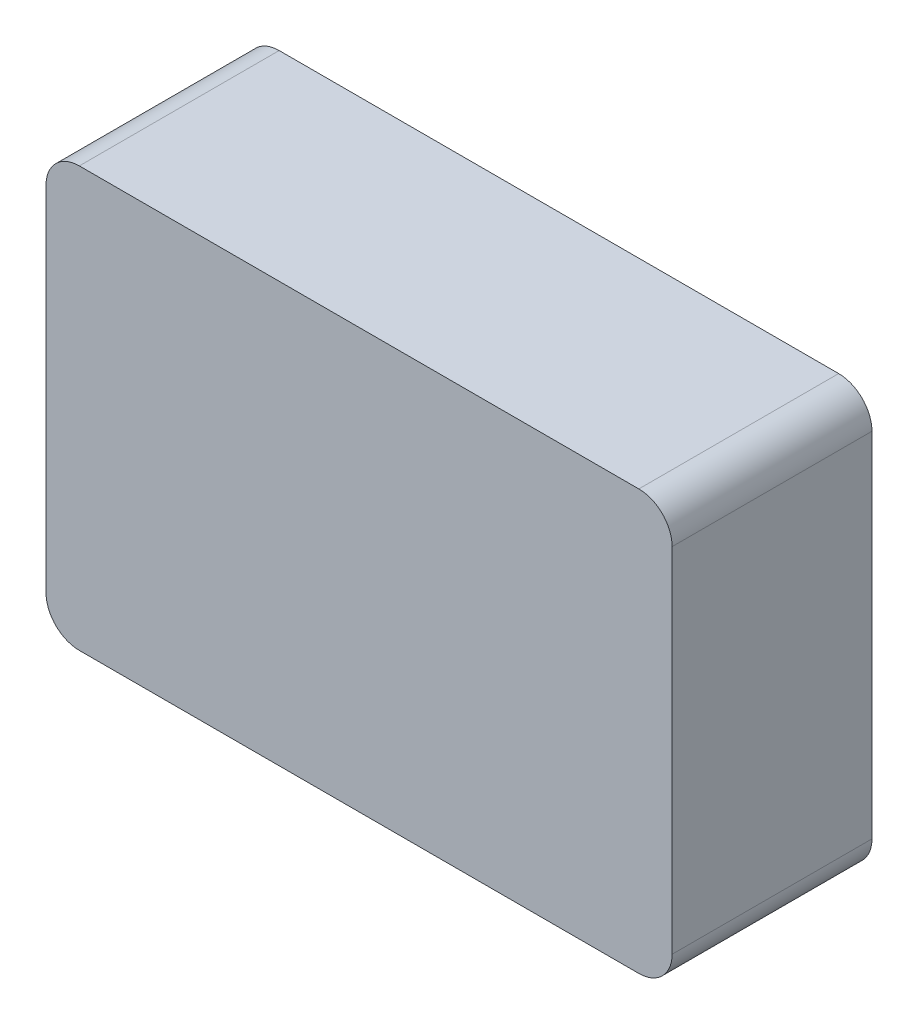
ISO-10303-21;
HEADER;
FILE_DESCRIPTION(('STEP AP214'),'2;1');
FILE_NAME('part.step','',(''),(''),'','','');
FILE_SCHEMA(('AUTOMOTIVE_DESIGN { 1 0 10303 214 1 1 1 1 }'));
ENDSEC;
DATA;
#1=APPLICATION_CONTEXT('core data for automotive mechanical design processes');
#2=APPLICATION_PROTOCOL_DEFINITION('international standard','automotive_design',2000,#1);
#3=PRODUCT_CONTEXT('',#1,'mechanical');
#4=PRODUCT('Part','Part','',(#3));
#5=PRODUCT_RELATED_PRODUCT_CATEGORY('part','',(#4));
#6=PRODUCT_DEFINITION_FORMATION('','',#4);
#7=PRODUCT_DEFINITION_CONTEXT('part definition',#1,'design');
#8=PRODUCT_DEFINITION('design','',#6,#7);
#9=PRODUCT_DEFINITION_SHAPE('','',#8);
#10=(LENGTH_UNIT() NAMED_UNIT(*) SI_UNIT(.MILLI.,.METRE.));
#11=(NAMED_UNIT(*) PLANE_ANGLE_UNIT() SI_UNIT($,.RADIAN.));
#12=(NAMED_UNIT(*) SI_UNIT($,.STERADIAN.) SOLID_ANGLE_UNIT());
#13=UNCERTAINTY_MEASURE_WITH_UNIT(LENGTH_MEASURE(1.E-05),#10,'distance_accuracy_value','');
#14=(GEOMETRIC_REPRESENTATION_CONTEXT(3) GLOBAL_UNCERTAINTY_ASSIGNED_CONTEXT((#13)) GLOBAL_UNIT_ASSIGNED_CONTEXT((#10,
#11,#12)) REPRESENTATION_CONTEXT('',''));
#15=CARTESIAN_POINT('',(0.,0.,0.));
#16=DIRECTION('',(0.,0.,1.));
#17=DIRECTION('',(1.,0.,0.));
#18=AXIS2_PLACEMENT_3D('',#15,#16,#17);
#19=CARTESIAN_POINT('',(-47.,26.5,30.));
#20=DIRECTION('',(1.,0.,0.));
#21=DIRECTION('',(0.,1.,0.));
#22=AXIS2_PLACEMENT_3D('',#19,#20,#21);
#23=PLANE('',#22);
#24=DIRECTION('',(0.,0.,-1.));
#25=VECTOR('',#24,1.);
#26=CARTESIAN_POINT('',(-47.,-26.5,30.));
#27=LINE('',#26,#25);
#28=CARTESIAN_POINT('',(-47.,-26.5,5.));
#29=VERTEX_POINT('',#28);
#30=CARTESIAN_POINT('',(-47.,-26.5,0.));
#31=VERTEX_POINT('',#30);
#32=EDGE_CURVE('E374',#29,#31,#27,.T.);
#33=ORIENTED_EDGE('',*,*,#32,.F.);
#34=DIRECTION('',(0.,-1.,0.));
#35=VECTOR('',#34,1.);
#36=CARTESIAN_POINT('',(-47.,26.5,5.));
#37=LINE('',#36,#35);
#38=CARTESIAN_POINT('',(-47.,26.5,5.));
#39=VERTEX_POINT('',#38);
#40=EDGE_CURVE('E48',#39,#29,#37,.T.);
#41=ORIENTED_EDGE('',*,*,#40,.F.);
#42=DIRECTION('',(0.,0.,-1.));
#43=VECTOR('',#42,1.);
#44=CARTESIAN_POINT('',(-47.,26.5,30.));
#45=LINE('',#44,#43);
#46=CARTESIAN_POINT('',(-47.,26.5,0.));
#47=VERTEX_POINT('',#46);
#48=EDGE_CURVE('E378',#39,#47,#45,.T.);
#49=ORIENTED_EDGE('',*,*,#48,.T.);
#50=DIRECTION('',(0.,-1.,0.));
#51=VECTOR('',#50,1.);
#52=CARTESIAN_POINT('',(-47.,26.5,0.));
#53=LINE('',#52,#51);
#54=EDGE_CURVE('E363',#47,#31,#53,.T.);
#55=ORIENTED_EDGE('',*,*,#54,.T.);
#56=EDGE_LOOP('',(#33,#41,#49,#55));
#57=FACE_BOUND('',#56,.T.);
#58=ADVANCED_FACE('F33',(#57),#23,.F.);
#59=CARTESIAN_POINT('',(42.,-26.5,30.));
#60=DIRECTION('',(0.,0.,-1.));
#61=DIRECTION('',(-1.,0.,0.));
#62=AXIS2_PLACEMENT_3D('',#59,#60,#61);
#63=CYLINDRICAL_SURFACE('',#62,5.);
#64=CARTESIAN_POINT('',(42.,-26.5,0.));
#65=DIRECTION('',(0.,0.,1.));
#66=DIRECTION('',(1.,0.,0.));
#67=AXIS2_PLACEMENT_3D('',#64,#65,#66);
#68=CIRCLE('',#67,5.);
#69=CARTESIAN_POINT('',(42.,-31.5,0.));
#70=VERTEX_POINT('',#69);
#71=CARTESIAN_POINT('',(47.,-26.5,0.));
#72=VERTEX_POINT('',#71);
#73=EDGE_CURVE('E259',#70,#72,#68,.T.);
#74=ORIENTED_EDGE('',*,*,#73,.T.);
#75=DIRECTION('',(0.,0.,-1.));
#76=VECTOR('',#75,1.);
#77=CARTESIAN_POINT('',(47.,-26.5,30.));
#78=LINE('',#77,#76);
#79=CARTESIAN_POINT('',(47.,-26.5,30.));
#80=VERTEX_POINT('',#79);
#81=EDGE_CURVE('E11',#80,#72,#78,.T.);
#82=ORIENTED_EDGE('',*,*,#81,.F.);
#83=CARTESIAN_POINT('',(42.,-26.5,30.));
#84=DIRECTION('',(0.,0.,1.));
#85=DIRECTION('',(1.,0.,0.));
#86=AXIS2_PLACEMENT_3D('',#83,#84,#85);
#87=CIRCLE('',#86,5.);
#88=CARTESIAN_POINT('',(42.,-31.5,30.));
#89=VERTEX_POINT('',#88);
#90=EDGE_CURVE('E333',#89,#80,#87,.T.);
#91=ORIENTED_EDGE('',*,*,#90,.F.);
#92=DIRECTION('',(0.,0.,-1.));
#93=VECTOR('',#92,1.);
#94=CARTESIAN_POINT('',(42.,-31.5,30.));
#95=LINE('',#94,#93);
#96=EDGE_CURVE('E351',#89,#70,#95,.T.);
#97=ORIENTED_EDGE('',*,*,#96,.T.);
#98=EDGE_LOOP('',(#74,#82,#91,#97));
#99=FACE_BOUND('',#98,.T.);
#100=ADVANCED_FACE('F35',(#99),#63,.T.);
#101=CARTESIAN_POINT('',(47.,26.5,30.));
#102=DIRECTION('',(-1.,0.,0.));
#103=DIRECTION('',(0.,-1.,0.));
#104=AXIS2_PLACEMENT_3D('',#101,#102,#103);
#105=PLANE('',#104);
#106=DIRECTION('',(0.,1.,0.));
#107=VECTOR('',#106,1.);
#108=CARTESIAN_POINT('',(47.,26.5,0.));
#109=LINE('',#108,#107);
#110=CARTESIAN_POINT('',(47.,26.5,0.));
#111=VERTEX_POINT('',#110);
#112=EDGE_CURVE('E354',#72,#111,#109,.T.);
#113=ORIENTED_EDGE('',*,*,#112,.T.);
#114=DIRECTION('',(0.,0.,-1.));
#115=VECTOR('',#114,1.);
#116=CARTESIAN_POINT('',(47.,26.5,30.));
#117=LINE('',#116,#115);
#118=CARTESIAN_POINT('',(47.,26.5,30.));
#119=VERTEX_POINT('',#118);
#120=EDGE_CURVE('E41',#119,#111,#117,.T.);
#121=ORIENTED_EDGE('',*,*,#120,.F.);
#122=DIRECTION('',(0.,1.,0.));
#123=VECTOR('',#122,1.);
#124=CARTESIAN_POINT('',(47.,26.5,30.));
#125=LINE('',#124,#123);
#126=EDGE_CURVE('E336',#80,#119,#125,.T.);
#127=ORIENTED_EDGE('',*,*,#126,.F.);
#128=ORIENTED_EDGE('',*,*,#81,.T.);
#129=EDGE_LOOP('',(#113,#121,#127,#128));
#130=FACE_BOUND('',#129,.T.);
#131=ADVANCED_FACE('F417',(#130),#105,.F.);
#132=CARTESIAN_POINT('',(42.,26.5,30.));
#133=DIRECTION('',(0.,0.,-1.));
#134=DIRECTION('',(-1.,0.,0.));
#135=AXIS2_PLACEMENT_3D('',#132,#133,#134);
#136=CYLINDRICAL_SURFACE('',#135,5.);
#137=CARTESIAN_POINT('',(42.,26.5,0.));
#138=DIRECTION('',(0.,0.,1.));
#139=DIRECTION('',(1.,0.,0.));
#140=AXIS2_PLACEMENT_3D('',#137,#138,#139);
#141=CIRCLE('',#140,5.);
#142=CARTESIAN_POINT('',(42.,31.5,0.));
#143=VERTEX_POINT('',#142);
#144=EDGE_CURVE('E356',#111,#143,#141,.T.);
#145=ORIENTED_EDGE('',*,*,#144,.T.);
#146=DIRECTION('',(0.,0.,-1.));
#147=VECTOR('',#146,1.);
#148=CARTESIAN_POINT('',(42.,31.5,30.));
#149=LINE('',#148,#147);
#150=CARTESIAN_POINT('',(42.,31.5,30.));
#151=VERTEX_POINT('',#150);
#152=EDGE_CURVE('E385',#151,#143,#149,.T.);
#153=ORIENTED_EDGE('',*,*,#152,.F.);
#154=CARTESIAN_POINT('',(42.,26.5,30.));
#155=DIRECTION('',(0.,0.,1.));
#156=DIRECTION('',(1.,0.,0.));
#157=AXIS2_PLACEMENT_3D('',#154,#155,#156);
#158=CIRCLE('',#157,5.);
#159=EDGE_CURVE('E339',#119,#151,#158,.T.);
#160=ORIENTED_EDGE('',*,*,#159,.F.);
#161=ORIENTED_EDGE('',*,*,#120,.T.);
#162=EDGE_LOOP('',(#145,#153,#160,#161));
#163=FACE_BOUND('',#162,.T.);
#164=ADVANCED_FACE('F392',(#163),#136,.T.);
#165=CARTESIAN_POINT('',(-42.,31.5,30.));
#166=DIRECTION('',(0.,-1.,0.));
#167=DIRECTION('',(0.,0.,-1.));
#168=AXIS2_PLACEMENT_3D('',#165,#166,#167);
#169=PLANE('',#168);
#170=DIRECTION('',(-1.,0.,0.));
#171=VECTOR('',#170,1.);
#172=CARTESIAN_POINT('',(-42.,31.5,0.));
#173=LINE('',#172,#171);
#174=CARTESIAN_POINT('',(-42.,31.5,0.));
#175=VERTEX_POINT('',#174);
#176=EDGE_CURVE('E358',#143,#175,#173,.T.);
#177=ORIENTED_EDGE('',*,*,#176,.T.);
#178=DIRECTION('',(0.,0.,-1.));
#179=VECTOR('',#178,1.);
#180=CARTESIAN_POINT('',(-42.,31.5,30.));
#181=LINE('',#180,#179);
#182=CARTESIAN_POINT('',(-42.,31.5,30.));
#183=VERTEX_POINT('',#182);
#184=EDGE_CURVE('E382',#183,#175,#181,.T.);
#185=ORIENTED_EDGE('',*,*,#184,.F.);
#186=DIRECTION('',(-1.,0.,0.));
#187=VECTOR('',#186,1.);
#188=CARTESIAN_POINT('',(-42.,31.5,30.));
#189=LINE('',#188,#187);
#190=EDGE_CURVE('E341',#151,#183,#189,.T.);
#191=ORIENTED_EDGE('',*,*,#190,.F.);
#192=ORIENTED_EDGE('',*,*,#152,.T.);
#193=EDGE_LOOP('',(#177,#185,#191,#192));
#194=FACE_BOUND('',#193,.T.);
#195=ADVANCED_FACE('F403',(#194),#169,.F.);
#196=CARTESIAN_POINT('',(-42.,26.5,30.));
#197=DIRECTION('',(0.,0.,-1.));
#198=DIRECTION('',(-1.,0.,0.));
#199=AXIS2_PLACEMENT_3D('',#196,#197,#198);
#200=CYLINDRICAL_SURFACE('',#199,5.);
#201=CARTESIAN_POINT('',(-42.,26.5,0.));
#202=DIRECTION('',(0.,0.,1.));
#203=DIRECTION('',(-1.,0.,0.));
#204=AXIS2_PLACEMENT_3D('',#201,#202,#203);
#205=CIRCLE('',#204,5.);
#206=EDGE_CURVE('E360',#175,#47,#205,.T.);
#207=ORIENTED_EDGE('',*,*,#206,.T.);
#208=ORIENTED_EDGE('',*,*,#48,.F.);
#209=DIRECTION('',(0.,0.,-1.));
#210=VECTOR('',#209,1.);
#211=CARTESIAN_POINT('',(-47.,26.5,5.));
#212=LINE('',#211,#210);
#213=CARTESIAN_POINT('',(-47.,26.5,25.));
#214=VERTEX_POINT('',#213);
#215=EDGE_CURVE('E214',#214,#39,#212,.T.);
#216=ORIENTED_EDGE('',*,*,#215,.F.);
#217=CARTESIAN_POINT('',(-47.,26.5,30.));
#218=VERTEX_POINT('',#217);
#219=EDGE_CURVE('E379',#218,#214,#45,.T.);
#220=ORIENTED_EDGE('',*,*,#219,.F.);
#221=CARTESIAN_POINT('',(-42.,26.5,30.));
#222=DIRECTION('',(0.,0.,1.));
#223=DIRECTION('',(-1.,0.,0.));
#224=AXIS2_PLACEMENT_3D('',#221,#222,#223);
#225=CIRCLE('',#224,5.);
#226=EDGE_CURVE('E343',#183,#218,#225,.T.);
#227=ORIENTED_EDGE('',*,*,#226,.F.);
#228=ORIENTED_EDGE('',*,*,#184,.T.);
#229=EDGE_LOOP('',(#207,#208,#216,#220,#227,#228));
#230=FACE_BOUND('',#229,.T.);
#231=ADVANCED_FACE('F407',(#230),#200,.T.);
#232=ORIENTED_EDGE('',*,*,#219,.T.);
#233=DIRECTION('',(0.,1.,0.));
#234=VECTOR('',#233,1.);
#235=CARTESIAN_POINT('',(-47.,26.5,25.));
#236=LINE('',#235,#234);
#237=CARTESIAN_POINT('',(-47.,-26.5,25.));
#238=VERTEX_POINT('',#237);
#239=EDGE_CURVE('E217',#238,#214,#236,.T.);
#240=ORIENTED_EDGE('',*,*,#239,.F.);
#241=CARTESIAN_POINT('',(-47.,-26.5,30.));
#242=VERTEX_POINT('',#241);
#243=EDGE_CURVE('E375',#242,#238,#27,.T.);
#244=ORIENTED_EDGE('',*,*,#243,.F.);
#245=DIRECTION('',(0.,-1.,0.));
#246=VECTOR('',#245,1.);
#247=CARTESIAN_POINT('',(-47.,26.5,30.));
#248=LINE('',#247,#246);
#249=EDGE_CURVE('E345',#218,#242,#248,.T.);
#250=ORIENTED_EDGE('',*,*,#249,.F.);
#251=EDGE_LOOP('',(#232,#240,#244,#250));
#252=FACE_BOUND('',#251,.T.);
#253=ADVANCED_FACE('F434',(#252),#23,.F.);
#254=CARTESIAN_POINT('',(-42.,-26.5,30.));
#255=DIRECTION('',(0.,0.,-1.));
#256=DIRECTION('',(-1.,0.,0.));
#257=AXIS2_PLACEMENT_3D('',#254,#255,#256);
#258=CYLINDRICAL_SURFACE('',#257,5.);
#259=CARTESIAN_POINT('',(-42.,-26.5,0.));
#260=DIRECTION('',(0.,0.,1.));
#261=DIRECTION('',(-1.,0.,0.));
#262=AXIS2_PLACEMENT_3D('',#259,#260,#261);
#263=CIRCLE('',#262,5.);
#264=CARTESIAN_POINT('',(-42.,-31.5,0.));
#265=VERTEX_POINT('',#264);
#266=EDGE_CURVE('E366',#31,#265,#263,.T.);
#267=ORIENTED_EDGE('',*,*,#266,.T.);
#268=DIRECTION('',(0.,0.,-1.));
#269=VECTOR('',#268,1.);
#270=CARTESIAN_POINT('',(-42.,-31.5,30.));
#271=LINE('',#270,#269);
#272=CARTESIAN_POINT('',(-42.,-31.5,30.));
#273=VERTEX_POINT('',#272);
#274=EDGE_CURVE('E371',#273,#265,#271,.T.);
#275=ORIENTED_EDGE('',*,*,#274,.F.);
#276=CARTESIAN_POINT('',(-42.,-26.5,30.));
#277=DIRECTION('',(0.,0.,1.));
#278=DIRECTION('',(-1.,0.,0.));
#279=AXIS2_PLACEMENT_3D('',#276,#277,#278);
#280=CIRCLE('',#279,5.);
#281=EDGE_CURVE('E347',#242,#273,#280,.T.);
#282=ORIENTED_EDGE('',*,*,#281,.F.);
#283=ORIENTED_EDGE('',*,*,#243,.T.);
#284=DIRECTION('',(0.,0.,1.));
#285=VECTOR('',#284,1.);
#286=CARTESIAN_POINT('',(-47.,-26.5,5.00000000000001));
#287=LINE('',#286,#285);
#288=EDGE_CURVE('E223',#29,#238,#287,.T.);
#289=ORIENTED_EDGE('',*,*,#288,.F.);
#290=ORIENTED_EDGE('',*,*,#32,.T.);
#291=EDGE_LOOP('',(#267,#275,#282,#283,#289,#290));
#292=FACE_BOUND('',#291,.T.);
#293=ADVANCED_FACE('F428',(#292),#258,.T.);
#294=CARTESIAN_POINT('',(-42.,-31.5,30.));
#295=DIRECTION('',(0.,1.,0.));
#296=DIRECTION('',(0.,0.,1.));
#297=AXIS2_PLACEMENT_3D('',#294,#295,#296);
#298=PLANE('',#297);
#299=DIRECTION('',(1.,0.,0.));
#300=VECTOR('',#299,1.);
#301=CARTESIAN_POINT('',(-35.,-31.5,8.));
#302=LINE('',#301,#300);
#303=CARTESIAN_POINT('',(-35.,-31.5,8.));
#304=VERTEX_POINT('',#303);
#305=CARTESIAN_POINT('',(-27.,-31.5,8.));
#306=VERTEX_POINT('',#305);
#307=EDGE_CURVE('E248',#304,#306,#302,.T.);
#308=ORIENTED_EDGE('',*,*,#307,.F.);
#309=CARTESIAN_POINT('',(-35.,-31.5,10.));
#310=DIRECTION('',(0.,-1.,0.));
#311=DIRECTION('',(0.,0.,-1.));
#312=AXIS2_PLACEMENT_3D('',#309,#310,#311);
#313=CIRCLE('',#312,2.);
#314=CARTESIAN_POINT('',(-35.,-31.5,12.));
#315=VERTEX_POINT('',#314);
#316=EDGE_CURVE('E56',#315,#304,#313,.T.);
#317=ORIENTED_EDGE('',*,*,#316,.F.);
#318=DIRECTION('',(-1.,0.,0.));
#319=VECTOR('',#318,1.);
#320=CARTESIAN_POINT('',(-35.,-31.5,12.));
#321=LINE('',#320,#319);
#322=CARTESIAN_POINT('',(-27.,-31.5,12.));
#323=VERTEX_POINT('',#322);
#324=EDGE_CURVE('E237',#323,#315,#321,.T.);
#325=ORIENTED_EDGE('',*,*,#324,.F.);
#326=CARTESIAN_POINT('',(-27.,-31.5,10.));
#327=DIRECTION('',(0.,-1.,0.));
#328=DIRECTION('',(0.,0.,-1.));
#329=AXIS2_PLACEMENT_3D('',#326,#327,#328);
#330=CIRCLE('',#329,2.);
#331=EDGE_CURVE('E252',#306,#323,#330,.T.);
#332=ORIENTED_EDGE('',*,*,#331,.F.);
#333=EDGE_LOOP('',(#308,#317,#325,#332));
#334=FACE_BOUND('',#333,.T.);
#335=DIRECTION('',(1.,0.,0.));
#336=VECTOR('',#335,1.);
#337=CARTESIAN_POINT('',(-19.,-31.5,8.));
#338=LINE('',#337,#336);
#339=CARTESIAN_POINT('',(-19.,-31.5,8.));
#340=VERTEX_POINT('',#339);
#341=CARTESIAN_POINT('',(-11.,-31.5,8.));
#342=VERTEX_POINT('',#341);
#343=EDGE_CURVE('E281',#340,#342,#338,.T.);
#344=ORIENTED_EDGE('',*,*,#343,.F.);
#345=CARTESIAN_POINT('',(-19.,-31.5,10.));
#346=DIRECTION('',(0.,-1.,0.));
#347=DIRECTION('',(0.,0.,-1.));
#348=AXIS2_PLACEMENT_3D('',#345,#346,#347);
#349=CIRCLE('',#348,2.);
#350=CARTESIAN_POINT('',(-19.,-31.5,12.));
#351=VERTEX_POINT('',#350);
#352=EDGE_CURVE('E279',#351,#340,#349,.T.);
#353=ORIENTED_EDGE('',*,*,#352,.F.);
#354=DIRECTION('',(-1.,0.,0.));
#355=VECTOR('',#354,1.);
#356=CARTESIAN_POINT('',(-19.,-31.5,12.));
#357=LINE('',#356,#355);
#358=CARTESIAN_POINT('',(-11.,-31.5,12.));
#359=VERTEX_POINT('',#358);
#360=EDGE_CURVE('E269',#359,#351,#357,.T.);
#361=ORIENTED_EDGE('',*,*,#360,.F.);
#362=CARTESIAN_POINT('',(-11.,-31.5,10.));
#363=DIRECTION('',(0.,-1.,0.));
#364=DIRECTION('',(0.,0.,-1.));
#365=AXIS2_PLACEMENT_3D('',#362,#363,#364);
#366=CIRCLE('',#365,2.);
#367=EDGE_CURVE('E285',#342,#359,#366,.T.);
#368=ORIENTED_EDGE('',*,*,#367,.F.);
#369=EDGE_LOOP('',(#344,#353,#361,#368));
#370=FACE_BOUND('',#369,.T.);
#371=DIRECTION('',(1.,0.,0.));
#372=VECTOR('',#371,1.);
#373=CARTESIAN_POINT('',(-3.,-31.5,8.));
#374=LINE('',#373,#372);
#375=CARTESIAN_POINT('',(-3.,-31.5,8.));
#376=VERTEX_POINT('',#375);
#377=CARTESIAN_POINT('',(5.,-31.5,8.));
#378=VERTEX_POINT('',#377);
#379=EDGE_CURVE('E313',#376,#378,#374,.T.);
#380=ORIENTED_EDGE('',*,*,#379,.F.);
#381=CARTESIAN_POINT('',(-3.,-31.5,10.));
#382=DIRECTION('',(0.,-1.,0.));
#383=DIRECTION('',(0.,0.,-1.));
#384=AXIS2_PLACEMENT_3D('',#381,#382,#383);
#385=CIRCLE('',#384,2.);
#386=CARTESIAN_POINT('',(-3.,-31.5,12.));
#387=VERTEX_POINT('',#386);
#388=EDGE_CURVE('E311',#387,#376,#385,.T.);
#389=ORIENTED_EDGE('',*,*,#388,.F.);
#390=DIRECTION('',(-1.,0.,0.));
#391=VECTOR('',#390,1.);
#392=CARTESIAN_POINT('',(-3.,-31.5,12.));
#393=LINE('',#392,#391);
#394=CARTESIAN_POINT('',(5.,-31.5,12.));
#395=VERTEX_POINT('',#394);
#396=EDGE_CURVE('E301',#395,#387,#393,.T.);
#397=ORIENTED_EDGE('',*,*,#396,.F.);
#398=CARTESIAN_POINT('',(5.,-31.5,10.));
#399=DIRECTION('',(0.,-1.,0.));
#400=DIRECTION('',(0.,0.,-1.));
#401=AXIS2_PLACEMENT_3D('',#398,#399,#400);
#402=CIRCLE('',#401,2.);
#403=EDGE_CURVE('E317',#378,#395,#402,.T.);
#404=ORIENTED_EDGE('',*,*,#403,.F.);
#405=EDGE_LOOP('',(#380,#389,#397,#404));
#406=FACE_BOUND('',#405,.T.);
#407=CARTESIAN_POINT('',(15.,-31.5,10.));
#408=DIRECTION('',(0.,-1.,0.));
#409=DIRECTION('',(0.,0.,-1.));
#410=AXIS2_PLACEMENT_3D('',#407,#408,#409);
#411=CIRCLE('',#410,2.);
#412=CARTESIAN_POINT('',(15.,-31.5,8.));
#413=VERTEX_POINT('',#412);
#414=EDGE_CURVE('E229',#413,#413,#411,.T.);
#415=ORIENTED_EDGE('',*,*,#414,.F.);
#416=EDGE_LOOP('',(#415));
#417=FACE_BOUND('',#416,.T.);
#418=DIRECTION('',(1.,0.,0.));
#419=VECTOR('',#418,1.);
#420=CARTESIAN_POINT('',(-42.,-31.5,0.));
#421=LINE('',#420,#419);
#422=EDGE_CURVE('E337',#265,#70,#421,.T.);
#423=ORIENTED_EDGE('',*,*,#422,.T.);
#424=ORIENTED_EDGE('',*,*,#96,.F.);
#425=DIRECTION('',(1.,0.,0.));
#426=VECTOR('',#425,1.);
#427=CARTESIAN_POINT('',(-42.,-31.5,30.));
#428=LINE('',#427,#426);
#429=EDGE_CURVE('E349',#273,#89,#428,.T.);
#430=ORIENTED_EDGE('',*,*,#429,.F.);
#431=ORIENTED_EDGE('',*,*,#274,.T.);
#432=EDGE_LOOP('',(#423,#424,#430,#431));
#433=FACE_BOUND('',#432,.T.);
#434=ADVANCED_FACE('F423',(#334,#370,#406,#417,#433),#298,.F.);
#435=CARTESIAN_POINT('',(42.,-26.5,30.));
#436=DIRECTION('',(0.,0.,1.));
#437=DIRECTION('',(1.,0.,0.));
#438=AXIS2_PLACEMENT_3D('',#435,#436,#437);
#439=PLANE('',#438);
#440=ORIENTED_EDGE('',*,*,#90,.T.);
#441=ORIENTED_EDGE('',*,*,#126,.T.);
#442=ORIENTED_EDGE('',*,*,#159,.T.);
#443=ORIENTED_EDGE('',*,*,#190,.T.);
#444=ORIENTED_EDGE('',*,*,#226,.T.);
#445=ORIENTED_EDGE('',*,*,#249,.T.);
#446=ORIENTED_EDGE('',*,*,#281,.T.);
#447=ORIENTED_EDGE('',*,*,#429,.T.);
#448=EDGE_LOOP('',(#440,#441,#442,#443,#444,#445,#446,#447));
#449=FACE_BOUND('',#448,.T.);
#450=ADVANCED_FACE('F413',(#449),#439,.T.);
#451=CARTESIAN_POINT('',(42.,-26.5,0.));
#452=DIRECTION('',(0.,0.,1.));
#453=DIRECTION('',(1.,0.,0.));
#454=AXIS2_PLACEMENT_3D('',#451,#452,#453);
#455=PLANE('',#454);
#456=ORIENTED_EDGE('',*,*,#73,.F.);
#457=ORIENTED_EDGE('',*,*,#422,.F.);
#458=ORIENTED_EDGE('',*,*,#266,.F.);
#459=ORIENTED_EDGE('',*,*,#54,.F.);
#460=ORIENTED_EDGE('',*,*,#206,.F.);
#461=ORIENTED_EDGE('',*,*,#176,.F.);
#462=ORIENTED_EDGE('',*,*,#144,.F.);
#463=ORIENTED_EDGE('',*,*,#112,.F.);
#464=EDGE_LOOP('',(#456,#457,#458,#459,#460,#461,#462,#463));
#465=FACE_BOUND('',#464,.T.);
#466=ADVANCED_FACE('F398',(#465),#455,.F.);
#467=CARTESIAN_POINT('',(15.,-29.5,10.));
#468=DIRECTION('',(0.,-1.,0.));
#469=DIRECTION('',(0.,0.,-1.));
#470=AXIS2_PLACEMENT_3D('',#467,#468,#469);
#471=CYLINDRICAL_SURFACE('',#470,2.);
#472=CARTESIAN_POINT('',(15.,-29.5,10.));
#473=DIRECTION('',(0.,-1.,0.));
#474=DIRECTION('',(0.,0.,-1.));
#475=AXIS2_PLACEMENT_3D('',#472,#473,#474);
#476=CIRCLE('',#475,2.);
#477=CARTESIAN_POINT('',(15.,-29.5,8.));
#478=VERTEX_POINT('',#477);
#479=EDGE_CURVE('E314',#478,#478,#476,.T.);
#480=ORIENTED_EDGE('',*,*,#479,.F.);
#481=EDGE_LOOP('',(#480));
#482=FACE_BOUND('',#481,.T.);
#483=ORIENTED_EDGE('',*,*,#414,.T.);
#484=EDGE_LOOP('',(#483));
#485=FACE_BOUND('',#484,.T.);
#486=ADVANCED_FACE('F499',(#482,#485),#471,.F.);
#487=CARTESIAN_POINT('',(15.,-29.5,10.));
#488=DIRECTION('',(0.,-1.,0.));
#489=DIRECTION('',(0.,0.,-1.));
#490=AXIS2_PLACEMENT_3D('',#487,#488,#489);
#491=PLANE('',#490);
#492=ORIENTED_EDGE('',*,*,#479,.T.);
#493=EDGE_LOOP('',(#492));
#494=FACE_BOUND('',#493,.T.);
#495=ADVANCED_FACE('F516',(#494),#491,.T.);
#496=CARTESIAN_POINT('',(-3.,-29.5,10.));
#497=DIRECTION('',(0.,-1.,0.));
#498=DIRECTION('',(0.,0.,-1.));
#499=AXIS2_PLACEMENT_3D('',#496,#497,#498);
#500=CYLINDRICAL_SURFACE('',#499,2.);
#501=ORIENTED_EDGE('',*,*,#388,.T.);
#502=DIRECTION('',(0.,-1.,0.));
#503=VECTOR('',#502,1.);
#504=CARTESIAN_POINT('',(-3.,-29.5,8.));
#505=LINE('',#504,#503);
#506=CARTESIAN_POINT('',(-3.,-29.5,8.));
#507=VERTEX_POINT('',#506);
#508=EDGE_CURVE('E310',#507,#376,#505,.T.);
#509=ORIENTED_EDGE('',*,*,#508,.F.);
#510=CARTESIAN_POINT('',(-3.,-29.5,10.));
#511=DIRECTION('',(0.,-1.,0.));
#512=DIRECTION('',(0.,0.,-1.));
#513=AXIS2_PLACEMENT_3D('',#510,#511,#512);
#514=CIRCLE('',#513,2.);
#515=CARTESIAN_POINT('',(-3.,-29.5,12.));
#516=VERTEX_POINT('',#515);
#517=EDGE_CURVE('E297',#516,#507,#514,.T.);
#518=ORIENTED_EDGE('',*,*,#517,.F.);
#519=DIRECTION('',(0.,-1.,0.));
#520=VECTOR('',#519,1.);
#521=CARTESIAN_POINT('',(-3.,-29.5,12.));
#522=LINE('',#521,#520);
#523=EDGE_CURVE('E282',#516,#387,#522,.T.);
#524=ORIENTED_EDGE('',*,*,#523,.T.);
#525=EDGE_LOOP('',(#501,#509,#518,#524));
#526=FACE_BOUND('',#525,.T.);
#527=ADVANCED_FACE('F526',(#526),#500,.F.);
#528=CARTESIAN_POINT('',(-3.,-29.5,12.));
#529=DIRECTION('',(0.,0.,1.));
#530=DIRECTION('',(1.,0.,0.));
#531=AXIS2_PLACEMENT_3D('',#528,#529,#530);
#532=PLANE('',#531);
#533=ORIENTED_EDGE('',*,*,#396,.T.);
#534=ORIENTED_EDGE('',*,*,#523,.F.);
#535=DIRECTION('',(-1.,0.,0.));
#536=VECTOR('',#535,1.);
#537=CARTESIAN_POINT('',(-3.,-29.5,12.));
#538=LINE('',#537,#536);
#539=CARTESIAN_POINT('',(5.,-29.5,12.));
#540=VERTEX_POINT('',#539);
#541=EDGE_CURVE('E307',#540,#516,#538,.T.);
#542=ORIENTED_EDGE('',*,*,#541,.F.);
#543=DIRECTION('',(0.,-1.,0.));
#544=VECTOR('',#543,1.);
#545=CARTESIAN_POINT('',(5.,-29.5,12.));
#546=LINE('',#545,#544);
#547=EDGE_CURVE('E323',#540,#395,#546,.T.);
#548=ORIENTED_EDGE('',*,*,#547,.T.);
#549=EDGE_LOOP('',(#533,#534,#542,#548));
#550=FACE_BOUND('',#549,.T.);
#551=ADVANCED_FACE('F536',(#550),#532,.F.);
#552=CARTESIAN_POINT('',(5.,-29.5,10.));
#553=DIRECTION('',(0.,-1.,0.));
#554=DIRECTION('',(0.,0.,-1.));
#555=AXIS2_PLACEMENT_3D('',#552,#553,#554);
#556=CYLINDRICAL_SURFACE('',#555,2.);
#557=ORIENTED_EDGE('',*,*,#403,.T.);
#558=ORIENTED_EDGE('',*,*,#547,.F.);
#559=CARTESIAN_POINT('',(5.,-29.5,10.));
#560=DIRECTION('',(0.,-1.,0.));
#561=DIRECTION('',(0.,0.,-1.));
#562=AXIS2_PLACEMENT_3D('',#559,#560,#561);
#563=CIRCLE('',#562,2.);
#564=CARTESIAN_POINT('',(5.,-29.5,8.));
#565=VERTEX_POINT('',#564);
#566=EDGE_CURVE('E304',#565,#540,#563,.T.);
#567=ORIENTED_EDGE('',*,*,#566,.F.);
#568=DIRECTION('',(0.,-1.,0.));
#569=VECTOR('',#568,1.);
#570=CARTESIAN_POINT('',(5.,-29.5,8.));
#571=LINE('',#570,#569);
#572=EDGE_CURVE('E325',#565,#378,#571,.T.);
#573=ORIENTED_EDGE('',*,*,#572,.T.);
#574=EDGE_LOOP('',(#557,#558,#567,#573));
#575=FACE_BOUND('',#574,.T.);
#576=ADVANCED_FACE('F546',(#575),#556,.F.);
#577=CARTESIAN_POINT('',(-3.,-29.5,8.));
#578=DIRECTION('',(0.,0.,-1.));
#579=DIRECTION('',(-1.,0.,0.));
#580=AXIS2_PLACEMENT_3D('',#577,#578,#579);
#581=PLANE('',#580);
#582=ORIENTED_EDGE('',*,*,#379,.T.);
#583=ORIENTED_EDGE('',*,*,#572,.F.);
#584=DIRECTION('',(1.,0.,0.));
#585=VECTOR('',#584,1.);
#586=CARTESIAN_POINT('',(-3.,-29.5,8.));
#587=LINE('',#586,#585);
#588=EDGE_CURVE('E300',#507,#565,#587,.T.);
#589=ORIENTED_EDGE('',*,*,#588,.F.);
#590=ORIENTED_EDGE('',*,*,#508,.T.);
#591=EDGE_LOOP('',(#582,#583,#589,#590));
#592=FACE_BOUND('',#591,.T.);
#593=ADVANCED_FACE('F556',(#592),#581,.F.);
#594=CARTESIAN_POINT('',(-3.,-29.5,10.));
#595=DIRECTION('',(0.,-1.,0.));
#596=DIRECTION('',(0.,0.,-1.));
#597=AXIS2_PLACEMENT_3D('',#594,#595,#596);
#598=PLANE('',#597);
#599=ORIENTED_EDGE('',*,*,#517,.T.);
#600=ORIENTED_EDGE('',*,*,#588,.T.);
#601=ORIENTED_EDGE('',*,*,#566,.T.);
#602=ORIENTED_EDGE('',*,*,#541,.T.);
#603=EDGE_LOOP('',(#599,#600,#601,#602));
#604=FACE_BOUND('',#603,.T.);
#605=ADVANCED_FACE('F566',(#604),#598,.T.);
#606=CARTESIAN_POINT('',(-19.,-29.5,10.));
#607=DIRECTION('',(0.,-1.,0.));
#608=DIRECTION('',(0.,0.,-1.));
#609=AXIS2_PLACEMENT_3D('',#606,#607,#608);
#610=CYLINDRICAL_SURFACE('',#609,2.);
#611=ORIENTED_EDGE('',*,*,#352,.T.);
#612=DIRECTION('',(0.,-1.,0.));
#613=VECTOR('',#612,1.);
#614=CARTESIAN_POINT('',(-19.,-29.5,8.));
#615=LINE('',#614,#613);
#616=CARTESIAN_POINT('',(-19.,-29.5,8.));
#617=VERTEX_POINT('',#616);
#618=EDGE_CURVE('E278',#617,#340,#615,.T.);
#619=ORIENTED_EDGE('',*,*,#618,.F.);
#620=CARTESIAN_POINT('',(-19.,-29.5,10.));
#621=DIRECTION('',(0.,-1.,0.));
#622=DIRECTION('',(0.,0.,-1.));
#623=AXIS2_PLACEMENT_3D('',#620,#621,#622);
#624=CIRCLE('',#623,2.);
#625=CARTESIAN_POINT('',(-19.,-29.5,12.));
#626=VERTEX_POINT('',#625);
#627=EDGE_CURVE('E265',#626,#617,#624,.T.);
#628=ORIENTED_EDGE('',*,*,#627,.F.);
#629=DIRECTION('',(0.,-1.,0.));
#630=VECTOR('',#629,1.);
#631=CARTESIAN_POINT('',(-19.,-29.5,12.));
#632=LINE('',#631,#630);
#633=EDGE_CURVE('E249',#626,#351,#632,.T.);
#634=ORIENTED_EDGE('',*,*,#633,.T.);
#635=EDGE_LOOP('',(#611,#619,#628,#634));
#636=FACE_BOUND('',#635,.T.);
#637=ADVANCED_FACE('F576',(#636),#610,.F.);
#638=CARTESIAN_POINT('',(-19.,-29.5,12.));
#639=DIRECTION('',(0.,0.,1.));
#640=DIRECTION('',(1.,0.,0.));
#641=AXIS2_PLACEMENT_3D('',#638,#639,#640);
#642=PLANE('',#641);
#643=ORIENTED_EDGE('',*,*,#360,.T.);
#644=ORIENTED_EDGE('',*,*,#633,.F.);
#645=DIRECTION('',(-1.,0.,0.));
#646=VECTOR('',#645,1.);
#647=CARTESIAN_POINT('',(-19.,-29.5,12.));
#648=LINE('',#647,#646);
#649=CARTESIAN_POINT('',(-11.,-29.5,12.));
#650=VERTEX_POINT('',#649);
#651=EDGE_CURVE('E275',#650,#626,#648,.T.);
#652=ORIENTED_EDGE('',*,*,#651,.F.);
#653=DIRECTION('',(0.,-1.,0.));
#654=VECTOR('',#653,1.);
#655=CARTESIAN_POINT('',(-11.,-29.5,12.));
#656=LINE('',#655,#654);
#657=EDGE_CURVE('E291',#650,#359,#656,.T.);
#658=ORIENTED_EDGE('',*,*,#657,.T.);
#659=EDGE_LOOP('',(#643,#644,#652,#658));
#660=FACE_BOUND('',#659,.T.);
#661=ADVANCED_FACE('F586',(#660),#642,.F.);
#662=CARTESIAN_POINT('',(-11.,-29.5,10.));
#663=DIRECTION('',(0.,-1.,0.));
#664=DIRECTION('',(0.,0.,-1.));
#665=AXIS2_PLACEMENT_3D('',#662,#663,#664);
#666=CYLINDRICAL_SURFACE('',#665,2.);
#667=ORIENTED_EDGE('',*,*,#367,.T.);
#668=ORIENTED_EDGE('',*,*,#657,.F.);
#669=CARTESIAN_POINT('',(-11.,-29.5,10.));
#670=DIRECTION('',(0.,-1.,0.));
#671=DIRECTION('',(0.,0.,-1.));
#672=AXIS2_PLACEMENT_3D('',#669,#670,#671);
#673=CIRCLE('',#672,2.);
#674=CARTESIAN_POINT('',(-11.,-29.5,8.));
#675=VERTEX_POINT('',#674);
#676=EDGE_CURVE('E272',#675,#650,#673,.T.);
#677=ORIENTED_EDGE('',*,*,#676,.F.);
#678=DIRECTION('',(0.,-1.,0.));
#679=VECTOR('',#678,1.);
#680=CARTESIAN_POINT('',(-11.,-29.5,8.));
#681=LINE('',#680,#679);
#682=EDGE_CURVE('E293',#675,#342,#681,.T.);
#683=ORIENTED_EDGE('',*,*,#682,.T.);
#684=EDGE_LOOP('',(#667,#668,#677,#683));
#685=FACE_BOUND('',#684,.T.);
#686=ADVANCED_FACE('F596',(#685),#666,.F.);
#687=CARTESIAN_POINT('',(-19.,-29.5,8.));
#688=DIRECTION('',(0.,0.,-1.));
#689=DIRECTION('',(-1.,0.,0.));
#690=AXIS2_PLACEMENT_3D('',#687,#688,#689);
#691=PLANE('',#690);
#692=ORIENTED_EDGE('',*,*,#343,.T.);
#693=ORIENTED_EDGE('',*,*,#682,.F.);
#694=DIRECTION('',(1.,0.,0.));
#695=VECTOR('',#694,1.);
#696=CARTESIAN_POINT('',(-19.,-29.5,8.));
#697=LINE('',#696,#695);
#698=EDGE_CURVE('E268',#617,#675,#697,.T.);
#699=ORIENTED_EDGE('',*,*,#698,.F.);
#700=ORIENTED_EDGE('',*,*,#618,.T.);
#701=EDGE_LOOP('',(#692,#693,#699,#700));
#702=FACE_BOUND('',#701,.T.);
#703=ADVANCED_FACE('F606',(#702),#691,.F.);
#704=CARTESIAN_POINT('',(-19.,-29.5,10.));
#705=DIRECTION('',(0.,-1.,0.));
#706=DIRECTION('',(0.,0.,-1.));
#707=AXIS2_PLACEMENT_3D('',#704,#705,#706);
#708=PLANE('',#707);
#709=ORIENTED_EDGE('',*,*,#627,.T.);
#710=ORIENTED_EDGE('',*,*,#698,.T.);
#711=ORIENTED_EDGE('',*,*,#676,.T.);
#712=ORIENTED_EDGE('',*,*,#651,.T.);
#713=EDGE_LOOP('',(#709,#710,#711,#712));
#714=FACE_BOUND('',#713,.T.);
#715=ADVANCED_FACE('F616',(#714),#708,.T.);
#716=CARTESIAN_POINT('',(-35.,-29.5,10.));
#717=DIRECTION('',(0.,-1.,0.));
#718=DIRECTION('',(0.,0.,-1.));
#719=AXIS2_PLACEMENT_3D('',#716,#717,#718);
#720=CYLINDRICAL_SURFACE('',#719,2.);
#721=ORIENTED_EDGE('',*,*,#316,.T.);
#722=DIRECTION('',(0.,-1.,0.));
#723=VECTOR('',#722,1.);
#724=CARTESIAN_POINT('',(-35.,-29.5,8.));
#725=LINE('',#724,#723);
#726=CARTESIAN_POINT('',(-35.,-29.5,8.));
#727=VERTEX_POINT('',#726);
#728=EDGE_CURVE('E246',#727,#304,#725,.T.);
#729=ORIENTED_EDGE('',*,*,#728,.F.);
#730=CARTESIAN_POINT('',(-35.,-29.5,10.));
#731=DIRECTION('',(0.,-1.,0.));
#732=DIRECTION('',(0.,0.,-1.));
#733=AXIS2_PLACEMENT_3D('',#730,#731,#732);
#734=CIRCLE('',#733,2.);
#735=CARTESIAN_POINT('',(-35.,-29.5,12.));
#736=VERTEX_POINT('',#735);
#737=EDGE_CURVE('E233',#736,#727,#734,.T.);
#738=ORIENTED_EDGE('',*,*,#737,.F.);
#739=DIRECTION('',(0.,-1.,0.));
#740=VECTOR('',#739,1.);
#741=CARTESIAN_POINT('',(-35.,-29.5,12.));
#742=LINE('',#741,#740);
#743=EDGE_CURVE('E257',#736,#315,#742,.T.);
#744=ORIENTED_EDGE('',*,*,#743,.T.);
#745=EDGE_LOOP('',(#721,#729,#738,#744));
#746=FACE_BOUND('',#745,.T.);
#747=ADVANCED_FACE('F626',(#746),#720,.F.);
#748=CARTESIAN_POINT('',(-35.,-29.5,12.));
#749=DIRECTION('',(0.,0.,1.));
#750=DIRECTION('',(1.,0.,0.));
#751=AXIS2_PLACEMENT_3D('',#748,#749,#750);
#752=PLANE('',#751);
#753=ORIENTED_EDGE('',*,*,#324,.T.);
#754=ORIENTED_EDGE('',*,*,#743,.F.);
#755=DIRECTION('',(-1.,0.,0.));
#756=VECTOR('',#755,1.);
#757=CARTESIAN_POINT('',(-35.,-29.5,12.));
#758=LINE('',#757,#756);
#759=CARTESIAN_POINT('',(-27.,-29.5,12.));
#760=VERTEX_POINT('',#759);
#761=EDGE_CURVE('E243',#760,#736,#758,.T.);
#762=ORIENTED_EDGE('',*,*,#761,.F.);
#763=DIRECTION('',(0.,-1.,0.));
#764=VECTOR('',#763,1.);
#765=CARTESIAN_POINT('',(-27.,-29.5,12.));
#766=LINE('',#765,#764);
#767=EDGE_CURVE('E260',#760,#323,#766,.T.);
#768=ORIENTED_EDGE('',*,*,#767,.T.);
#769=EDGE_LOOP('',(#753,#754,#762,#768));
#770=FACE_BOUND('',#769,.T.);
#771=ADVANCED_FACE('F636',(#770),#752,.F.);
#772=CARTESIAN_POINT('',(-27.,-29.5,10.));
#773=DIRECTION('',(0.,-1.,0.));
#774=DIRECTION('',(0.,0.,-1.));
#775=AXIS2_PLACEMENT_3D('',#772,#773,#774);
#776=CYLINDRICAL_SURFACE('',#775,2.);
#777=ORIENTED_EDGE('',*,*,#331,.T.);
#778=ORIENTED_EDGE('',*,*,#767,.F.);
#779=CARTESIAN_POINT('',(-27.,-29.5,10.));
#780=DIRECTION('',(0.,-1.,0.));
#781=DIRECTION('',(0.,0.,-1.));
#782=AXIS2_PLACEMENT_3D('',#779,#780,#781);
#783=CIRCLE('',#782,2.);
#784=CARTESIAN_POINT('',(-27.,-29.5,8.));
#785=VERTEX_POINT('',#784);
#786=EDGE_CURVE('E240',#785,#760,#783,.T.);
#787=ORIENTED_EDGE('',*,*,#786,.F.);
#788=DIRECTION('',(0.,-1.,0.));
#789=VECTOR('',#788,1.);
#790=CARTESIAN_POINT('',(-27.,-29.5,8.));
#791=LINE('',#790,#789);
#792=EDGE_CURVE('E262',#785,#306,#791,.T.);
#793=ORIENTED_EDGE('',*,*,#792,.T.);
#794=EDGE_LOOP('',(#777,#778,#787,#793));
#795=FACE_BOUND('',#794,.T.);
#796=ADVANCED_FACE('F645',(#795),#776,.F.);
#797=CARTESIAN_POINT('',(-35.,-29.5,8.));
#798=DIRECTION('',(0.,0.,-1.));
#799=DIRECTION('',(-1.,0.,0.));
#800=AXIS2_PLACEMENT_3D('',#797,#798,#799);
#801=PLANE('',#800);
#802=ORIENTED_EDGE('',*,*,#307,.T.);
#803=ORIENTED_EDGE('',*,*,#792,.F.);
#804=DIRECTION('',(1.,0.,0.));
#805=VECTOR('',#804,1.);
#806=CARTESIAN_POINT('',(-35.,-29.5,8.));
#807=LINE('',#806,#805);
#808=EDGE_CURVE('E236',#727,#785,#807,.T.);
#809=ORIENTED_EDGE('',*,*,#808,.F.);
#810=ORIENTED_EDGE('',*,*,#728,.T.);
#811=EDGE_LOOP('',(#802,#803,#809,#810));
#812=FACE_BOUND('',#811,.T.);
#813=ADVANCED_FACE('F655',(#812),#801,.F.);
#814=CARTESIAN_POINT('',(-35.,-29.5,10.));
#815=DIRECTION('',(0.,-1.,0.));
#816=DIRECTION('',(0.,0.,-1.));
#817=AXIS2_PLACEMENT_3D('',#814,#815,#816);
#818=PLANE('',#817);
#819=ORIENTED_EDGE('',*,*,#737,.T.);
#820=ORIENTED_EDGE('',*,*,#808,.T.);
#821=ORIENTED_EDGE('',*,*,#786,.T.);
#822=ORIENTED_EDGE('',*,*,#761,.T.);
#823=EDGE_LOOP('',(#819,#820,#821,#822));
#824=FACE_BOUND('',#823,.T.);
#825=ADVANCED_FACE('F445',(#824),#818,.T.);
#826=CARTESIAN_POINT('',(-42.,26.5,5.));
#827=DIRECTION('',(0.,0.,-1.));
#828=DIRECTION('',(0.,1.,0.));
#829=AXIS2_PLACEMENT_3D('',#826,#827,#828);
#830=PLANE('',#829);
#831=ORIENTED_EDGE('',*,*,#40,.T.);
#832=DIRECTION('',(-1.,0.,0.));
#833=VECTOR('',#832,1.);
#834=CARTESIAN_POINT('',(-42.,-26.5,5.00000000000001));
#835=LINE('',#834,#833);
#836=CARTESIAN_POINT('',(-42.,-26.5,5.00000000000001));
#837=VERTEX_POINT('',#836);
#838=EDGE_CURVE('E192',#837,#29,#835,.T.);
#839=ORIENTED_EDGE('',*,*,#838,.F.);
#840=DIRECTION('',(0.,-1.,0.));
#841=VECTOR('',#840,1.);
#842=CARTESIAN_POINT('',(-42.,26.5,5.));
#843=LINE('',#842,#841);
#844=CARTESIAN_POINT('',(-42.,26.5,5.));
#845=VERTEX_POINT('',#844);
#846=EDGE_CURVE('E196',#845,#837,#843,.T.);
#847=ORIENTED_EDGE('',*,*,#846,.F.);
#848=DIRECTION('',(-1.,0.,0.));
#849=VECTOR('',#848,1.);
#850=CARTESIAN_POINT('',(-42.,26.5,5.));
#851=LINE('',#850,#849);
#852=EDGE_CURVE('E227',#845,#39,#851,.T.);
#853=ORIENTED_EDGE('',*,*,#852,.T.);
#854=EDGE_LOOP('',(#831,#839,#847,#853));
#855=FACE_BOUND('',#854,.T.);
#856=ADVANCED_FACE('F194',(#855),#830,.F.);
#857=CARTESIAN_POINT('',(-42.,26.5,5.));
#858=DIRECTION('',(0.,1.,0.));
#859=DIRECTION('',(-1.,0.,0.));
#860=AXIS2_PLACEMENT_3D('',#857,#858,#859);
#861=PLANE('',#860);
#862=ORIENTED_EDGE('',*,*,#215,.T.);
#863=ORIENTED_EDGE('',*,*,#852,.F.);
#864=DIRECTION('',(0.,0.,-1.));
#865=VECTOR('',#864,1.);
#866=CARTESIAN_POINT('',(-42.,26.5,5.));
#867=LINE('',#866,#865);
#868=CARTESIAN_POINT('',(-42.,26.5,25.));
#869=VERTEX_POINT('',#868);
#870=EDGE_CURVE('E202',#869,#845,#867,.T.);
#871=ORIENTED_EDGE('',*,*,#870,.F.);
#872=DIRECTION('',(-1.,0.,0.));
#873=VECTOR('',#872,1.);
#874=CARTESIAN_POINT('',(-42.,26.5,25.));
#875=LINE('',#874,#873);
#876=EDGE_CURVE('E230',#869,#214,#875,.T.);
#877=ORIENTED_EDGE('',*,*,#876,.T.);
#878=EDGE_LOOP('',(#862,#863,#871,#877));
#879=FACE_BOUND('',#878,.T.);
#880=ADVANCED_FACE('F437',(#879),#861,.F.);
#881=CARTESIAN_POINT('',(-42.,26.5,25.));
#882=DIRECTION('',(0.,0.,1.));
#883=DIRECTION('',(0.,-1.,0.));
#884=AXIS2_PLACEMENT_3D('',#881,#882,#883);
#885=PLANE('',#884);
#886=ORIENTED_EDGE('',*,*,#239,.T.);
#887=ORIENTED_EDGE('',*,*,#876,.F.);
#888=DIRECTION('',(0.,1.,0.));
#889=VECTOR('',#888,1.);
#890=CARTESIAN_POINT('',(-42.,26.5,25.));
#891=LINE('',#890,#889);
#892=CARTESIAN_POINT('',(-42.,-26.5,25.));
#893=VERTEX_POINT('',#892);
#894=EDGE_CURVE('E210',#893,#869,#891,.T.);
#895=ORIENTED_EDGE('',*,*,#894,.F.);
#896=DIRECTION('',(-1.,0.,0.));
#897=VECTOR('',#896,1.);
#898=CARTESIAN_POINT('',(-42.,-26.5,25.));
#899=LINE('',#898,#897);
#900=EDGE_CURVE('E201',#893,#238,#899,.T.);
#901=ORIENTED_EDGE('',*,*,#900,.T.);
#902=EDGE_LOOP('',(#886,#887,#895,#901));
#903=FACE_BOUND('',#902,.T.);
#904=ADVANCED_FACE('F436',(#903),#885,.F.);
#905=CARTESIAN_POINT('',(-42.,-26.5,5.00000000000001));
#906=DIRECTION('',(0.,-1.,0.));
#907=DIRECTION('',(1.,0.,0.));
#908=AXIS2_PLACEMENT_3D('',#905,#906,#907);
#909=PLANE('',#908);
#910=ORIENTED_EDGE('',*,*,#288,.T.);
#911=ORIENTED_EDGE('',*,*,#900,.F.);
#912=DIRECTION('',(0.,0.,1.));
#913=VECTOR('',#912,1.);
#914=CARTESIAN_POINT('',(-42.,-26.5,5.00000000000001));
#915=LINE('',#914,#913);
#916=EDGE_CURVE('E205',#837,#893,#915,.T.);
#917=ORIENTED_EDGE('',*,*,#916,.F.);
#918=ORIENTED_EDGE('',*,*,#838,.T.);
#919=EDGE_LOOP('',(#910,#911,#917,#918));
#920=FACE_BOUND('',#919,.T.);
#921=ADVANCED_FACE('F206',(#920),#909,.F.);
#922=CARTESIAN_POINT('',(-42.,0.,0.));
#923=DIRECTION('',(-1.,0.,0.));
#924=DIRECTION('',(0.,-1.,0.));
#925=AXIS2_PLACEMENT_3D('',#922,#923,#924);
#926=PLANE('',#925);
#927=ORIENTED_EDGE('',*,*,#846,.T.);
#928=ORIENTED_EDGE('',*,*,#916,.T.);
#929=ORIENTED_EDGE('',*,*,#894,.T.);
#930=ORIENTED_EDGE('',*,*,#870,.T.);
#931=EDGE_LOOP('',(#927,#928,#929,#930));
#932=FACE_BOUND('',#931,.T.);
#933=ADVANCED_FACE('F212',(#932),#926,.T.);
#934=CLOSED_SHELL('',(#58,#100,#131,#164,#195,#231,#253,#293,#434,#450,#466,#486,#495,#527,#551,
#576,#593,#605,#637,#661,#686,#703,#715,#747,#771,#796,#813,#825,#856,#880,#904,#921,#933));
#935=MANIFOLD_SOLID_BREP('B2',#934);
#936=ADVANCED_BREP_SHAPE_REPRESENTATION('',(#18,#935),#14);
#937=SHAPE_DEFINITION_REPRESENTATION(#9,#936);
ENDSEC;
END-ISO-10303-21;
